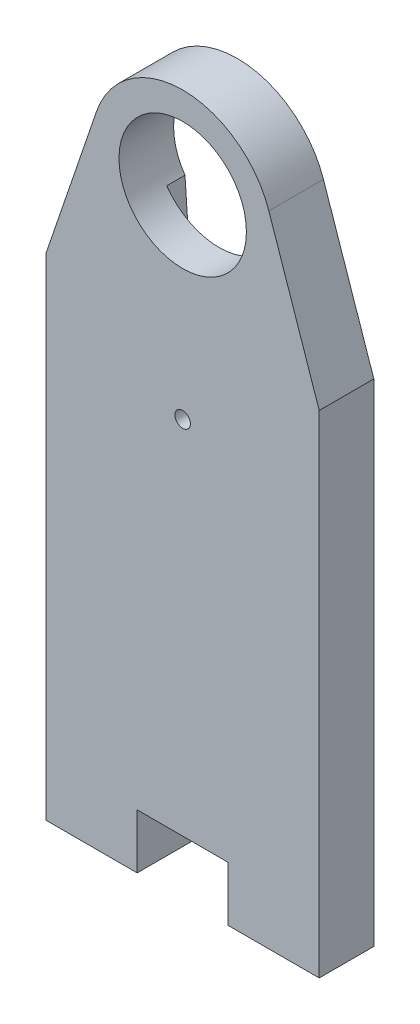
ISO-10303-21;
HEADER;
FILE_DESCRIPTION(('STEP AP214'),'2;1');
FILE_NAME('part.step','',(''),(''),'','','');
FILE_SCHEMA(('AUTOMOTIVE_DESIGN { 1 0 10303 214 1 1 1 1 }'));
ENDSEC;
DATA;
#1=APPLICATION_CONTEXT('core data for automotive mechanical design processes');
#2=APPLICATION_PROTOCOL_DEFINITION('international standard','automotive_design',2000,#1);
#3=PRODUCT_CONTEXT('',#1,'mechanical');
#4=PRODUCT('Part','Part','',(#3));
#5=PRODUCT_RELATED_PRODUCT_CATEGORY('part','',(#4));
#6=PRODUCT_DEFINITION_FORMATION('','',#4);
#7=PRODUCT_DEFINITION_CONTEXT('part definition',#1,'design');
#8=PRODUCT_DEFINITION('design','',#6,#7);
#9=PRODUCT_DEFINITION_SHAPE('','',#8);
#10=(LENGTH_UNIT() NAMED_UNIT(*) SI_UNIT(.MILLI.,.METRE.));
#11=(NAMED_UNIT(*) PLANE_ANGLE_UNIT() SI_UNIT($,.RADIAN.));
#12=(NAMED_UNIT(*) SI_UNIT($,.STERADIAN.) SOLID_ANGLE_UNIT());
#13=UNCERTAINTY_MEASURE_WITH_UNIT(LENGTH_MEASURE(1.E-05),#10,'distance_accuracy_value','');
#14=(GEOMETRIC_REPRESENTATION_CONTEXT(3) GLOBAL_UNCERTAINTY_ASSIGNED_CONTEXT((#13)) GLOBAL_UNIT_ASSIGNED_CONTEXT((#10,
#11,#12)) REPRESENTATION_CONTEXT('',''));
#15=CARTESIAN_POINT('',(0.,0.,0.));
#16=DIRECTION('',(0.,0.,1.));
#17=DIRECTION('',(1.,0.,0.));
#18=AXIS2_PLACEMENT_3D('',#15,#16,#17);
#19=CARTESIAN_POINT('',(32.5157769301917,30.1892162150804,0.));
#20=DIRECTION('',(0.,0.,1.));
#21=DIRECTION('',(1.,0.,0.));
#22=AXIS2_PLACEMENT_3D('',#19,#20,#21);
#23=PLANE('',#22);
#24=CARTESIAN_POINT('',(32.5157769301917,30.1892162150804,0.));
#25=DIRECTION('',(0.,0.,1.));
#26=DIRECTION('',(1.,0.,0.));
#27=AXIS2_PLACEMENT_3D('',#24,#25,#26);
#28=CIRCLE('',#27,5.0000000000082);
#29=CARTESIAN_POINT('',(37.2480556940772,31.803384019542,0.));
#30=VERTEX_POINT('',#29);
#31=CARTESIAN_POINT('',(27.7834981663142,31.8033840195655,0.));
#32=VERTEX_POINT('',#31);
#33=EDGE_CURVE('E154',#30,#32,#28,.T.);
#34=ORIENTED_EDGE('',*,*,#33,.F.);
#35=DIRECTION('',(-0.322833560893537,0.946455752774951,0.));
#36=VECTOR('',#35,1.);
#37=CARTESIAN_POINT('',(37.2480556940772,31.803384019542,0.));
#38=LINE('',#37,#36);
#39=CARTESIAN_POINT('',(40.0157769301994,23.6892162150703,0.));
#40=VERTEX_POINT('',#39);
#41=EDGE_CURVE('E95',#40,#30,#38,.T.);
#42=ORIENTED_EDGE('',*,*,#41,.F.);
#43=DIRECTION('',(0.,1.,0.));
#44=VECTOR('',#43,1.);
#45=CARTESIAN_POINT('',(40.0157769301994,10.6892162150705,0.));
#46=LINE('',#45,#44);
#47=CARTESIAN_POINT('',(40.0157769301994,-3.3107837849295,0.));
#48=VERTEX_POINT('',#47);
#49=EDGE_CURVE('E171',#48,#40,#46,.T.);
#50=ORIENTED_EDGE('',*,*,#49,.F.);
#51=DIRECTION('',(1.,0.,0.));
#52=VECTOR('',#51,1.);
#53=CARTESIAN_POINT('',(40.0157769301994,-3.3107837849295,0.));
#54=LINE('',#53,#52);
#55=CARTESIAN_POINT('',(35.0157769301985,-3.31078378492961,0.));
#56=VERTEX_POINT('',#55);
#57=EDGE_CURVE('E143',#56,#48,#54,.T.);
#58=ORIENTED_EDGE('',*,*,#57,.F.);
#59=DIRECTION('',(0.,-1.,0.));
#60=VECTOR('',#59,1.);
#61=CARTESIAN_POINT('',(35.0157769301985,-3.31078378492961,0.));
#62=LINE('',#61,#60);
#63=CARTESIAN_POINT('',(35.0157769301985,-0.310783784929612,0.));
#64=VERTEX_POINT('',#63);
#65=EDGE_CURVE('E168',#64,#56,#62,.T.);
#66=ORIENTED_EDGE('',*,*,#65,.F.);
#67=DIRECTION('',(1.,0.,0.));
#68=VECTOR('',#67,1.);
#69=CARTESIAN_POINT('',(35.0157769301985,-0.310783784929612,0.));
#70=LINE('',#69,#68);
#71=CARTESIAN_POINT('',(30.0157769301994,-0.310783784929612,0.));
#72=VERTEX_POINT('',#71);
#73=EDGE_CURVE('E166',#72,#64,#70,.T.);
#74=ORIENTED_EDGE('',*,*,#73,.F.);
#75=DIRECTION('',(0.,1.,0.));
#76=VECTOR('',#75,1.);
#77=CARTESIAN_POINT('',(30.0157769301994,-0.310783784929612,0.));
#78=LINE('',#77,#76);
#79=CARTESIAN_POINT('',(30.0157769301994,-3.31078378492961,0.));
#80=VERTEX_POINT('',#79);
#81=EDGE_CURVE('E164',#80,#72,#78,.T.);
#82=ORIENTED_EDGE('',*,*,#81,.F.);
#83=DIRECTION('',(1.,0.,0.));
#84=VECTOR('',#83,1.);
#85=CARTESIAN_POINT('',(30.0157769301994,-3.31078378492961,0.));
#86=LINE('',#85,#84);
#87=CARTESIAN_POINT('',(25.0157769302156,-3.31078378492961,0.));
#88=VERTEX_POINT('',#87);
#89=EDGE_CURVE('E162',#88,#80,#86,.T.);
#90=ORIENTED_EDGE('',*,*,#89,.F.);
#91=DIRECTION('',(0.,-1.,0.));
#92=VECTOR('',#91,1.);
#93=CARTESIAN_POINT('',(25.0157769302156,-3.31078378492961,0.));
#94=LINE('',#93,#92);
#95=CARTESIAN_POINT('',(25.0157769302156,23.6892162150653,0.));
#96=VERTEX_POINT('',#95);
#97=EDGE_CURVE('E160',#96,#88,#94,.T.);
#98=ORIENTED_EDGE('',*,*,#97,.F.);
#99=DIRECTION('',(-0.322833560890054,-0.946455752776139,0.));
#100=VECTOR('',#99,1.);
#101=CARTESIAN_POINT('',(25.0157769302156,23.6892162150653,0.));
#102=LINE('',#101,#100);
#103=EDGE_CURVE('E157',#32,#96,#102,.T.);
#104=ORIENTED_EDGE('',*,*,#103,.F.);
#105=EDGE_LOOP('',(#34,#42,#50,#58,#66,#74,#82,#90,#98,#104));
#106=FACE_BOUND('',#105,.T.);
#107=DIRECTION('',(0.0694233825828919,-0.997587286381873,0.));
#108=VECTOR('',#107,1.);
#109=CARTESIAN_POINT('',(30.5206023574377,15.5503694499056,0.));
#110=LINE('',#109,#108);
#111=CARTESIAN_POINT('',(29.6407769301985,28.1931221910495,0.));
#112=VERTEX_POINT('',#111);
#113=CARTESIAN_POINT('',(30.5206023574377,15.5503694499056,0.));
#114=VERTEX_POINT('',#113);
#115=EDGE_CURVE('E250',#112,#114,#110,.T.);
#116=ORIENTED_EDGE('',*,*,#115,.T.);
#117=CARTESIAN_POINT('',(32.5157769302006,15.6892162150706,0.));
#118=DIRECTION('',(0.,0.,1.));
#119=DIRECTION('',(1.,0.,0.));
#120=AXIS2_PLACEMENT_3D('',#117,#118,#119);
#121=CIRCLE('',#120,1.99999999999904);
#122=CARTESIAN_POINT('',(34.5109515029634,15.5503694499055,0.));
#123=VERTEX_POINT('',#122);
#124=EDGE_CURVE('E247',#114,#123,#121,.T.);
#125=ORIENTED_EDGE('',*,*,#124,.T.);
#126=DIRECTION('',(0.0694233825824549,0.997587286381904,0.));
#127=VECTOR('',#126,1.);
#128=CARTESIAN_POINT('',(35.3907769301985,28.1931221910705,0.));
#129=LINE('',#128,#127);
#130=CARTESIAN_POINT('',(35.3907769301985,28.1931221910705,0.));
#131=VERTEX_POINT('',#130);
#132=EDGE_CURVE('E243',#123,#131,#129,.T.);
#133=ORIENTED_EDGE('',*,*,#132,.T.);
#134=CARTESIAN_POINT('',(32.5157769301917,30.1892162150804,0.));
#135=DIRECTION('',(0.,0.,1.));
#136=DIRECTION('',(1.,0.,0.));
#137=AXIS2_PLACEMENT_3D('',#134,#135,#136);
#138=CIRCLE('',#137,3.50000233610408);
#139=EDGE_CURVE('E224',#131,#112,#138,.T.);
#140=ORIENTED_EDGE('',*,*,#139,.T.);
#141=EDGE_LOOP('',(#116,#125,#133,#140));
#142=FACE_BOUND('',#141,.T.);
#143=ADVANCED_FACE('F32',(#106,#142),#23,.F.);
#144=CARTESIAN_POINT('',(32.5157769301917,30.1892162150804,3.));
#145=DIRECTION('',(0.,0.,-1.));
#146=DIRECTION('',(-1.,0.,0.));
#147=AXIS2_PLACEMENT_3D('',#144,#145,#146);
#148=CYLINDRICAL_SURFACE('',#147,3.50000233610408);
#149=CARTESIAN_POINT('',(32.5157769301917,30.1892162150804,3.));
#150=DIRECTION('',(0.,0.,1.));
#151=DIRECTION('',(1.,0.,0.));
#152=AXIS2_PLACEMENT_3D('',#149,#150,#151);
#153=CIRCLE('',#152,3.50000233610408);
#154=CARTESIAN_POINT('',(36.0157792662958,30.1892162150804,3.));
#155=VERTEX_POINT('',#154);
#156=EDGE_CURVE('E223',#155,#155,#153,.T.);
#157=ORIENTED_EDGE('',*,*,#156,.T.);
#158=EDGE_LOOP('',(#157));
#159=FACE_BOUND('',#158,.T.);
#160=CARTESIAN_POINT('',(32.5157769301912,30.1892162150802,1.));
#161=DIRECTION('',(0.,0.,-1.));
#162=DIRECTION('',(1.,0.,0.));
#163=AXIS2_PLACEMENT_3D('',#160,#161,#162);
#164=CIRCLE('',#163,3.50000233610339);
#165=CARTESIAN_POINT('',(35.3907769301985,28.1931221910705,1.));
#166=VERTEX_POINT('',#165);
#167=CARTESIAN_POINT('',(29.6407769301984,28.1931221910494,1.));
#168=VERTEX_POINT('',#167);
#169=EDGE_CURVE('E246',#166,#168,#164,.T.);
#170=ORIENTED_EDGE('',*,*,#169,.T.);
#171=DIRECTION('',(0.,0.,-1.));
#172=VECTOR('',#171,1.);
#173=CARTESIAN_POINT('',(29.6407769301985,28.1931221910495,1.));
#174=LINE('',#173,#172);
#175=EDGE_CURVE('E47',#168,#112,#174,.T.);
#176=ORIENTED_EDGE('',*,*,#175,.T.);
#177=ORIENTED_EDGE('',*,*,#139,.F.);
#178=DIRECTION('',(0.,0.,-1.));
#179=VECTOR('',#178,1.);
#180=CARTESIAN_POINT('',(35.3907769301985,28.1931221910705,1.));
#181=LINE('',#180,#179);
#182=EDGE_CURVE('E239',#166,#131,#181,.T.);
#183=ORIENTED_EDGE('',*,*,#182,.F.);
#184=EDGE_LOOP('',(#170,#176,#177,#183));
#185=FACE_BOUND('',#184,.T.);
#186=ADVANCED_FACE('F264',(#159,#185),#148,.F.);
#187=CARTESIAN_POINT('',(32.5157769301917,30.1892162150804,3.));
#188=DIRECTION('',(0.,0.,1.));
#189=DIRECTION('',(1.,0.,0.));
#190=AXIS2_PLACEMENT_3D('',#187,#188,#189);
#191=PLANE('',#190);
#192=CARTESIAN_POINT('',(32.5157769301994,19.5169867615704,3.));
#193=DIRECTION('',(0.,0.,1.));
#194=DIRECTION('',(1.,0.,0.));
#195=AXIS2_PLACEMENT_3D('',#192,#193,#194);
#196=CIRCLE('',#195,0.425000000000002);
#197=CARTESIAN_POINT('',(32.9407769301994,19.5169867615704,3.));
#198=VERTEX_POINT('',#197);
#199=EDGE_CURVE('E158',#198,#198,#196,.T.);
#200=ORIENTED_EDGE('',*,*,#199,.F.);
#201=EDGE_LOOP('',(#200));
#202=FACE_BOUND('',#201,.T.);
#203=CARTESIAN_POINT('',(32.5157769301917,30.1892162150804,3.));
#204=DIRECTION('',(0.,0.,1.));
#205=DIRECTION('',(1.,0.,0.));
#206=AXIS2_PLACEMENT_3D('',#203,#204,#205);
#207=CIRCLE('',#206,5.0000000000082);
#208=CARTESIAN_POINT('',(37.2480556940772,31.803384019542,3.));
#209=VERTEX_POINT('',#208);
#210=CARTESIAN_POINT('',(27.7834981663142,31.8033840195655,3.));
#211=VERTEX_POINT('',#210);
#212=EDGE_CURVE('E174',#209,#211,#207,.T.);
#213=ORIENTED_EDGE('',*,*,#212,.T.);
#214=DIRECTION('',(-0.322833560890054,-0.946455752776139,0.));
#215=VECTOR('',#214,1.);
#216=CARTESIAN_POINT('',(25.0157769302156,23.6892162150653,3.));
#217=LINE('',#216,#215);
#218=CARTESIAN_POINT('',(25.0157769302156,23.6892162150653,3.));
#219=VERTEX_POINT('',#218);
#220=EDGE_CURVE('E103',#211,#219,#217,.T.);
#221=ORIENTED_EDGE('',*,*,#220,.T.);
#222=DIRECTION('',(0.,-1.,0.));
#223=VECTOR('',#222,1.);
#224=CARTESIAN_POINT('',(25.0157769302156,-3.31078378492961,3.));
#225=LINE('',#224,#223);
#226=CARTESIAN_POINT('',(25.0157769302156,-3.31078378492961,3.));
#227=VERTEX_POINT('',#226);
#228=EDGE_CURVE('E195',#219,#227,#225,.T.);
#229=ORIENTED_EDGE('',*,*,#228,.T.);
#230=DIRECTION('',(1.,0.,0.));
#231=VECTOR('',#230,1.);
#232=CARTESIAN_POINT('',(30.0157769301994,-3.31078378492961,3.));
#233=LINE('',#232,#231);
#234=CARTESIAN_POINT('',(30.0157769301994,-3.31078378492961,3.));
#235=VERTEX_POINT('',#234);
#236=EDGE_CURVE('E213',#227,#235,#233,.T.);
#237=ORIENTED_EDGE('',*,*,#236,.T.);
#238=DIRECTION('',(0.,1.,0.));
#239=VECTOR('',#238,1.);
#240=CARTESIAN_POINT('',(30.0157769301994,-0.310783784929612,3.));
#241=LINE('',#240,#239);
#242=CARTESIAN_POINT('',(30.0157769301994,-0.310783784929612,3.));
#243=VERTEX_POINT('',#242);
#244=EDGE_CURVE('E210',#235,#243,#241,.T.);
#245=ORIENTED_EDGE('',*,*,#244,.T.);
#246=DIRECTION('',(1.,0.,0.));
#247=VECTOR('',#246,1.);
#248=CARTESIAN_POINT('',(35.0157769301985,-0.310783784929612,3.));
#249=LINE('',#248,#247);
#250=CARTESIAN_POINT('',(35.0157769301985,-0.310783784929612,3.));
#251=VERTEX_POINT('',#250);
#252=EDGE_CURVE('E212',#243,#251,#249,.T.);
#253=ORIENTED_EDGE('',*,*,#252,.T.);
#254=DIRECTION('',(0.,-1.,0.));
#255=VECTOR('',#254,1.);
#256=CARTESIAN_POINT('',(35.0157769301985,-3.31078378492961,3.));
#257=LINE('',#256,#255);
#258=CARTESIAN_POINT('',(35.0157769301985,-3.31078378492961,3.));
#259=VERTEX_POINT('',#258);
#260=EDGE_CURVE('E133',#251,#259,#257,.T.);
#261=ORIENTED_EDGE('',*,*,#260,.T.);
#262=DIRECTION('',(1.,0.,0.));
#263=VECTOR('',#262,1.);
#264=CARTESIAN_POINT('',(40.0157769301994,-3.3107837849295,3.));
#265=LINE('',#264,#263);
#266=CARTESIAN_POINT('',(40.0157769301994,-3.3107837849295,3.));
#267=VERTEX_POINT('',#266);
#268=EDGE_CURVE('E125',#259,#267,#265,.T.);
#269=ORIENTED_EDGE('',*,*,#268,.T.);
#270=DIRECTION('',(0.,1.,0.));
#271=VECTOR('',#270,1.);
#272=CARTESIAN_POINT('',(40.0157769301994,-3.3107837849295,3.));
#273=LINE('',#272,#271);
#274=CARTESIAN_POINT('',(40.0157769301994,23.6892162150703,3.));
#275=VERTEX_POINT('',#274);
#276=EDGE_CURVE('E130',#267,#275,#273,.T.);
#277=ORIENTED_EDGE('',*,*,#276,.T.);
#278=DIRECTION('',(-0.322833560893537,0.946455752774951,0.));
#279=VECTOR('',#278,1.);
#280=CARTESIAN_POINT('',(37.2480556940772,31.803384019542,3.));
#281=LINE('',#280,#279);
#282=EDGE_CURVE('E56',#275,#209,#281,.T.);
#283=ORIENTED_EDGE('',*,*,#282,.T.);
#284=EDGE_LOOP('',(#213,#221,#229,#237,#245,#253,#261,#269,#277,#283));
#285=FACE_BOUND('',#284,.T.);
#286=ORIENTED_EDGE('',*,*,#156,.F.);
#287=EDGE_LOOP('',(#286));
#288=FACE_BOUND('',#287,.T.);
#289=ADVANCED_FACE('F127',(#202,#285,#288),#191,.T.);
#290=CARTESIAN_POINT('',(32.5157769301917,30.1892162150804,3.));
#291=DIRECTION('',(0.,0.,-1.));
#292=DIRECTION('',(-1.,0.,0.));
#293=AXIS2_PLACEMENT_3D('',#290,#291,#292);
#294=CYLINDRICAL_SURFACE('',#293,5.0000000000082);
#295=ORIENTED_EDGE('',*,*,#33,.T.);
#296=DIRECTION('',(0.,0.,-1.));
#297=VECTOR('',#296,1.);
#298=CARTESIAN_POINT('',(27.7834981663142,31.8033840195655,3.));
#299=LINE('',#298,#297);
#300=EDGE_CURVE('E11',#211,#32,#299,.T.);
#301=ORIENTED_EDGE('',*,*,#300,.F.);
#302=ORIENTED_EDGE('',*,*,#212,.F.);
#303=DIRECTION('',(0.,0.,-1.));
#304=VECTOR('',#303,1.);
#305=CARTESIAN_POINT('',(37.2480556940772,31.803384019542,3.));
#306=LINE('',#305,#304);
#307=EDGE_CURVE('E150',#209,#30,#306,.T.);
#308=ORIENTED_EDGE('',*,*,#307,.T.);
#309=EDGE_LOOP('',(#295,#301,#302,#308));
#310=FACE_BOUND('',#309,.T.);
#311=ADVANCED_FACE('F34',(#310),#294,.T.);
#312=CARTESIAN_POINT('',(25.0157769302156,23.6892162150653,3.));
#313=DIRECTION('',(0.946455752776139,-0.322833560890054,0.));
#314=DIRECTION('',(0.322833560890054,0.946455752776139,0.));
#315=AXIS2_PLACEMENT_3D('',#312,#313,#314);
#316=PLANE('',#315);
#317=ORIENTED_EDGE('',*,*,#103,.T.);
#318=DIRECTION('',(0.,0.,-1.));
#319=VECTOR('',#318,1.);
#320=CARTESIAN_POINT('',(25.0157769302156,23.6892162150653,3.));
#321=LINE('',#320,#319);
#322=EDGE_CURVE('E40',#219,#96,#321,.T.);
#323=ORIENTED_EDGE('',*,*,#322,.F.);
#324=ORIENTED_EDGE('',*,*,#220,.F.);
#325=ORIENTED_EDGE('',*,*,#300,.T.);
#326=EDGE_LOOP('',(#317,#323,#324,#325));
#327=FACE_BOUND('',#326,.T.);
#328=ADVANCED_FACE('F329',(#327),#316,.F.);
#329=CARTESIAN_POINT('',(25.0157769302156,-3.31078378492961,3.));
#330=DIRECTION('',(1.,0.,0.));
#331=DIRECTION('',(0.,0.,-1.));
#332=AXIS2_PLACEMENT_3D('',#329,#330,#331);
#333=PLANE('',#332);
#334=ORIENTED_EDGE('',*,*,#97,.T.);
#335=DIRECTION('',(0.,0.,-1.));
#336=VECTOR('',#335,1.);
#337=CARTESIAN_POINT('',(25.0157769302156,-3.31078378492961,3.));
#338=LINE('',#337,#336);
#339=EDGE_CURVE('E187',#227,#88,#338,.T.);
#340=ORIENTED_EDGE('',*,*,#339,.F.);
#341=ORIENTED_EDGE('',*,*,#228,.F.);
#342=ORIENTED_EDGE('',*,*,#322,.T.);
#343=EDGE_LOOP('',(#334,#340,#341,#342));
#344=FACE_BOUND('',#343,.T.);
#345=ADVANCED_FACE('F193',(#344),#333,.F.);
#346=CARTESIAN_POINT('',(30.0157769301994,-3.31078378492961,3.));
#347=DIRECTION('',(0.,1.,0.));
#348=DIRECTION('',(0.,0.,1.));
#349=AXIS2_PLACEMENT_3D('',#346,#347,#348);
#350=PLANE('',#349);
#351=ORIENTED_EDGE('',*,*,#89,.T.);
#352=DIRECTION('',(0.,0.,-1.));
#353=VECTOR('',#352,1.);
#354=CARTESIAN_POINT('',(30.0157769301994,-3.31078378492961,3.));
#355=LINE('',#354,#353);
#356=EDGE_CURVE('E184',#235,#80,#355,.T.);
#357=ORIENTED_EDGE('',*,*,#356,.F.);
#358=ORIENTED_EDGE('',*,*,#236,.F.);
#359=ORIENTED_EDGE('',*,*,#339,.T.);
#360=EDGE_LOOP('',(#351,#357,#358,#359));
#361=FACE_BOUND('',#360,.T.);
#362=ADVANCED_FACE('F204',(#361),#350,.F.);
#363=CARTESIAN_POINT('',(30.0157769301994,-0.310783784929612,3.));
#364=DIRECTION('',(-1.,0.,0.));
#365=DIRECTION('',(0.,0.,1.));
#366=AXIS2_PLACEMENT_3D('',#363,#364,#365);
#367=PLANE('',#366);
#368=ORIENTED_EDGE('',*,*,#81,.T.);
#369=DIRECTION('',(0.,0.,-1.));
#370=VECTOR('',#369,1.);
#371=CARTESIAN_POINT('',(30.0157769301994,-0.310783784929612,3.));
#372=LINE('',#371,#370);
#373=EDGE_CURVE('E181',#243,#72,#372,.T.);
#374=ORIENTED_EDGE('',*,*,#373,.F.);
#375=ORIENTED_EDGE('',*,*,#244,.F.);
#376=ORIENTED_EDGE('',*,*,#356,.T.);
#377=EDGE_LOOP('',(#368,#374,#375,#376));
#378=FACE_BOUND('',#377,.T.);
#379=ADVANCED_FACE('F208',(#378),#367,.F.);
#380=CARTESIAN_POINT('',(35.0157769301985,-0.310783784929612,3.));
#381=DIRECTION('',(0.,1.,0.));
#382=DIRECTION('',(0.,0.,1.));
#383=AXIS2_PLACEMENT_3D('',#380,#381,#382);
#384=PLANE('',#383);
#385=ORIENTED_EDGE('',*,*,#73,.T.);
#386=DIRECTION('',(0.,0.,-1.));
#387=VECTOR('',#386,1.);
#388=CARTESIAN_POINT('',(35.0157769301985,-0.310783784929612,3.));
#389=LINE('',#388,#387);
#390=EDGE_CURVE('E178',#251,#64,#389,.T.);
#391=ORIENTED_EDGE('',*,*,#390,.F.);
#392=ORIENTED_EDGE('',*,*,#252,.F.);
#393=ORIENTED_EDGE('',*,*,#373,.T.);
#394=EDGE_LOOP('',(#385,#391,#392,#393));
#395=FACE_BOUND('',#394,.T.);
#396=ADVANCED_FACE('F319',(#395),#384,.F.);
#397=CARTESIAN_POINT('',(35.0157769301985,-3.31078378492961,3.));
#398=DIRECTION('',(1.,0.,0.));
#399=DIRECTION('',(0.,0.,-1.));
#400=AXIS2_PLACEMENT_3D('',#397,#398,#399);
#401=PLANE('',#400);
#402=ORIENTED_EDGE('',*,*,#65,.T.);
#403=DIRECTION('',(0.,0.,-1.));
#404=VECTOR('',#403,1.);
#405=CARTESIAN_POINT('',(35.0157769301985,-3.31078378492961,3.));
#406=LINE('',#405,#404);
#407=EDGE_CURVE('E145',#259,#56,#406,.T.);
#408=ORIENTED_EDGE('',*,*,#407,.F.);
#409=ORIENTED_EDGE('',*,*,#260,.F.);
#410=ORIENTED_EDGE('',*,*,#390,.T.);
#411=EDGE_LOOP('',(#402,#408,#409,#410));
#412=FACE_BOUND('',#411,.T.);
#413=ADVANCED_FACE('F316',(#412),#401,.F.);
#414=CARTESIAN_POINT('',(40.0157769301994,-3.3107837849295,3.));
#415=DIRECTION('',(0.,1.,0.));
#416=DIRECTION('',(-1.,0.,0.));
#417=AXIS2_PLACEMENT_3D('',#414,#415,#416);
#418=PLANE('',#417);
#419=ORIENTED_EDGE('',*,*,#57,.T.);
#420=DIRECTION('',(0.,0.,-1.));
#421=VECTOR('',#420,1.);
#422=CARTESIAN_POINT('',(40.0157769301994,-3.3107837849295,3.));
#423=LINE('',#422,#421);
#424=EDGE_CURVE('E140',#267,#48,#423,.T.);
#425=ORIENTED_EDGE('',*,*,#424,.F.);
#426=ORIENTED_EDGE('',*,*,#268,.F.);
#427=ORIENTED_EDGE('',*,*,#407,.T.);
#428=EDGE_LOOP('',(#419,#425,#426,#427));
#429=FACE_BOUND('',#428,.T.);
#430=ADVANCED_FACE('F141',(#429),#418,.F.);
#431=CARTESIAN_POINT('',(40.0157769301994,10.6892162150705,3.));
#432=DIRECTION('',(-1.,0.,0.));
#433=DIRECTION('',(0.,0.,1.));
#434=AXIS2_PLACEMENT_3D('',#431,#432,#433);
#435=PLANE('',#434);
#436=ORIENTED_EDGE('',*,*,#49,.T.);
#437=DIRECTION('',(0.,0.,-1.));
#438=VECTOR('',#437,1.);
#439=CARTESIAN_POINT('',(40.0157769301994,23.6892162150703,3.));
#440=LINE('',#439,#438);
#441=EDGE_CURVE('E146',#275,#40,#440,.T.);
#442=ORIENTED_EDGE('',*,*,#441,.F.);
#443=ORIENTED_EDGE('',*,*,#276,.F.);
#444=ORIENTED_EDGE('',*,*,#424,.T.);
#445=EDGE_LOOP('',(#436,#442,#443,#444));
#446=FACE_BOUND('',#445,.T.);
#447=ADVANCED_FACE('F148',(#446),#435,.F.);
#448=CARTESIAN_POINT('',(37.2480556940772,31.803384019542,3.));
#449=DIRECTION('',(-0.946455752774951,-0.322833560893537,0.));
#450=DIRECTION('',(0.322833560893537,-0.946455752774951,0.));
#451=AXIS2_PLACEMENT_3D('',#448,#449,#450);
#452=PLANE('',#451);
#453=ORIENTED_EDGE('',*,*,#41,.T.);
#454=ORIENTED_EDGE('',*,*,#307,.F.);
#455=ORIENTED_EDGE('',*,*,#282,.F.);
#456=ORIENTED_EDGE('',*,*,#441,.T.);
#457=EDGE_LOOP('',(#453,#454,#455,#456));
#458=FACE_BOUND('',#457,.T.);
#459=ADVANCED_FACE('F308',(#458),#452,.F.);
#460=CARTESIAN_POINT('',(32.5157769301994,19.5169867615704,3.));
#461=DIRECTION('',(0.,0.,-1.));
#462=DIRECTION('',(-1.,0.,0.));
#463=AXIS2_PLACEMENT_3D('',#460,#461,#462);
#464=CYLINDRICAL_SURFACE('',#463,0.425000000000002);
#465=CARTESIAN_POINT('',(32.5157769301994,19.5169867615704,1.));
#466=DIRECTION('',(0.,0.,1.));
#467=DIRECTION('',(1.,0.,0.));
#468=AXIS2_PLACEMENT_3D('',#465,#466,#467);
#469=CIRCLE('',#468,0.425000000000002);
#470=CARTESIAN_POINT('',(32.9407769301994,19.5169867615704,1.));
#471=VERTEX_POINT('',#470);
#472=EDGE_CURVE('E227',#471,#471,#469,.T.);
#473=ORIENTED_EDGE('',*,*,#472,.F.);
#474=EDGE_LOOP('',(#473));
#475=FACE_BOUND('',#474,.T.);
#476=ORIENTED_EDGE('',*,*,#199,.T.);
#477=EDGE_LOOP('',(#476));
#478=FACE_BOUND('',#477,.T.);
#479=ADVANCED_FACE('F311',(#475,#478),#464,.F.);
#480=CARTESIAN_POINT('',(30.5206023574377,15.5503694499056,1.));
#481=DIRECTION('',(0.997587286381873,0.0694233825828919,0.));
#482=DIRECTION('',(-0.0694233825828919,0.997587286381873,0.));
#483=AXIS2_PLACEMENT_3D('',#480,#481,#482);
#484=PLANE('',#483);
#485=ORIENTED_EDGE('',*,*,#115,.F.);
#486=ORIENTED_EDGE('',*,*,#175,.F.);
#487=DIRECTION('',(0.0694233825828919,-0.997587286381873,0.));
#488=VECTOR('',#487,1.);
#489=CARTESIAN_POINT('',(30.5206023574377,15.5503694499056,1.));
#490=LINE('',#489,#488);
#491=CARTESIAN_POINT('',(30.5206023574377,15.5503694499056,1.));
#492=VERTEX_POINT('',#491);
#493=EDGE_CURVE('E258',#168,#492,#490,.T.);
#494=ORIENTED_EDGE('',*,*,#493,.T.);
#495=DIRECTION('',(0.,0.,-1.));
#496=VECTOR('',#495,1.);
#497=CARTESIAN_POINT('',(30.5206023574377,15.5503694499056,1.));
#498=LINE('',#497,#496);
#499=EDGE_CURVE('E233',#492,#114,#498,.T.);
#500=ORIENTED_EDGE('',*,*,#499,.T.);
#501=EDGE_LOOP('',(#485,#486,#494,#500));
#502=FACE_BOUND('',#501,.T.);
#503=ADVANCED_FACE('F286',(#502),#484,.T.);
#504=CARTESIAN_POINT('',(32.5157769302006,15.6892162150706,1.));
#505=DIRECTION('',(0.,0.,-1.));
#506=DIRECTION('',(-1.,0.,0.));
#507=AXIS2_PLACEMENT_3D('',#504,#505,#506);
#508=CYLINDRICAL_SURFACE('',#507,1.99999999999904);
#509=ORIENTED_EDGE('',*,*,#124,.F.);
#510=ORIENTED_EDGE('',*,*,#499,.F.);
#511=CARTESIAN_POINT('',(32.5157769302006,15.6892162150706,1.));
#512=DIRECTION('',(0.,0.,1.));
#513=DIRECTION('',(1.,0.,0.));
#514=AXIS2_PLACEMENT_3D('',#511,#512,#513);
#515=CIRCLE('',#514,1.99999999999904);
#516=CARTESIAN_POINT('',(34.5109515029634,15.5503694499055,1.));
#517=VERTEX_POINT('',#516);
#518=EDGE_CURVE('E255',#492,#517,#515,.T.);
#519=ORIENTED_EDGE('',*,*,#518,.T.);
#520=DIRECTION('',(0.,0.,-1.));
#521=VECTOR('',#520,1.);
#522=CARTESIAN_POINT('',(34.5109515029634,15.5503694499055,1.));
#523=LINE('',#522,#521);
#524=EDGE_CURVE('E236',#517,#123,#523,.T.);
#525=ORIENTED_EDGE('',*,*,#524,.T.);
#526=EDGE_LOOP('',(#509,#510,#519,#525));
#527=FACE_BOUND('',#526,.T.);
#528=ADVANCED_FACE('F287',(#527),#508,.F.);
#529=CARTESIAN_POINT('',(35.3907769301985,28.1931221910705,1.));
#530=DIRECTION('',(-0.997587286381904,0.0694233825824549,0.));
#531=DIRECTION('',(-0.0694233825824549,-0.997587286381904,0.));
#532=AXIS2_PLACEMENT_3D('',#529,#530,#531);
#533=PLANE('',#532);
#534=ORIENTED_EDGE('',*,*,#132,.F.);
#535=ORIENTED_EDGE('',*,*,#524,.F.);
#536=DIRECTION('',(0.0694233825824549,0.997587286381904,0.));
#537=VECTOR('',#536,1.);
#538=CARTESIAN_POINT('',(35.3907769301985,28.1931221910705,1.));
#539=LINE('',#538,#537);
#540=EDGE_CURVE('E242',#517,#166,#539,.T.);
#541=ORIENTED_EDGE('',*,*,#540,.T.);
#542=ORIENTED_EDGE('',*,*,#182,.T.);
#543=EDGE_LOOP('',(#534,#535,#541,#542));
#544=FACE_BOUND('',#543,.T.);
#545=ADVANCED_FACE('F288',(#544),#533,.T.);
#546=CARTESIAN_POINT('',(32.5157769301912,30.1892162150802,1.));
#547=DIRECTION('',(0.,0.,1.));
#548=DIRECTION('',(1.,0.,0.));
#549=AXIS2_PLACEMENT_3D('',#546,#547,#548);
#550=PLANE('',#549);
#551=ORIENTED_EDGE('',*,*,#472,.T.);
#552=EDGE_LOOP('',(#551));
#553=FACE_BOUND('',#552,.T.);
#554=ORIENTED_EDGE('',*,*,#169,.F.);
#555=ORIENTED_EDGE('',*,*,#540,.F.);
#556=ORIENTED_EDGE('',*,*,#518,.F.);
#557=ORIENTED_EDGE('',*,*,#493,.F.);
#558=EDGE_LOOP('',(#554,#555,#556,#557));
#559=FACE_BOUND('',#558,.T.);
#560=ADVANCED_FACE('F269',(#553,#559),#550,.F.);
#561=CLOSED_SHELL('',(#143,#186,#289,#311,#328,#345,#362,#379,#396,#413,#430,#447,#459,#479,
#503,#528,#545,#560));
#562=MANIFOLD_SOLID_BREP('B2',#561);
#563=ADVANCED_BREP_SHAPE_REPRESENTATION('',(#18,#562),#14);
#564=SHAPE_DEFINITION_REPRESENTATION(#9,#563);
ENDSEC;
END-ISO-10303-21;
